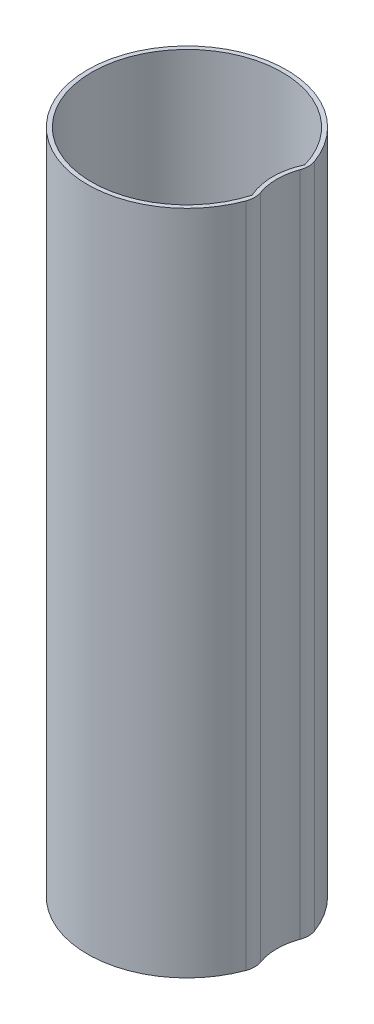
ISO-10303-21;
HEADER;
FILE_DESCRIPTION(('STEP AP214'),'2;1');
FILE_NAME('part.step','',(''),(''),'','','');
FILE_SCHEMA(('AUTOMOTIVE_DESIGN { 1 0 10303 214 1 1 1 1 }'));
ENDSEC;
DATA;
#1=APPLICATION_CONTEXT('core data for automotive mechanical design processes');
#2=APPLICATION_PROTOCOL_DEFINITION('international standard','automotive_design',2000,#1);
#3=PRODUCT_CONTEXT('',#1,'mechanical');
#4=PRODUCT('Part','Part','',(#3));
#5=PRODUCT_RELATED_PRODUCT_CATEGORY('part','',(#4));
#6=PRODUCT_DEFINITION_FORMATION('','',#4);
#7=PRODUCT_DEFINITION_CONTEXT('part definition',#1,'design');
#8=PRODUCT_DEFINITION('design','',#6,#7);
#9=PRODUCT_DEFINITION_SHAPE('','',#8);
#10=(LENGTH_UNIT() NAMED_UNIT(*) SI_UNIT(.MILLI.,.METRE.));
#11=(NAMED_UNIT(*) PLANE_ANGLE_UNIT() SI_UNIT($,.RADIAN.));
#12=(NAMED_UNIT(*) SI_UNIT($,.STERADIAN.) SOLID_ANGLE_UNIT());
#13=UNCERTAINTY_MEASURE_WITH_UNIT(LENGTH_MEASURE(1.E-05),#10,'distance_accuracy_value','');
#14=(GEOMETRIC_REPRESENTATION_CONTEXT(3) GLOBAL_UNCERTAINTY_ASSIGNED_CONTEXT((#13)) GLOBAL_UNIT_ASSIGNED_CONTEXT((#10,
#11,#12)) REPRESENTATION_CONTEXT('',''));
#15=CARTESIAN_POINT('',(0.,0.,0.));
#16=DIRECTION('',(0.,0.,1.));
#17=DIRECTION('',(1.,0.,0.));
#18=AXIS2_PLACEMENT_3D('',#15,#16,#17);
#19=CARTESIAN_POINT('',(7.,63.,0.));
#20=DIRECTION('',(0.,1.,0.));
#21=DIRECTION('',(0.,0.,1.));
#22=AXIS2_PLACEMENT_3D('',#19,#20,#21);
#23=PLANE('',#22);
#24=CARTESIAN_POINT('',(0.,63.,0.));
#25=DIRECTION('',(0.,1.,0.));
#26=DIRECTION('',(0.,0.,1.));
#27=AXIS2_PLACEMENT_3D('',#24,#25,#26);
#28=CIRCLE('',#27,9.4);
#29=CARTESIAN_POINT('',(8.82429536679536,63.,-3.23910655575791));
#30=VERTEX_POINT('',#29);
#31=CARTESIAN_POINT('',(8.82429536679537,63.,3.23910655575791));
#32=VERTEX_POINT('',#31);
#33=EDGE_CURVE('E113',#30,#32,#28,.T.);
#34=ORIENTED_EDGE('',*,*,#33,.T.);
#35=CARTESIAN_POINT('',(6.94678571428571,63.,2.54993494814984));
#36=DIRECTION('',(0.,1.,0.));
#37=DIRECTION('',(0.,0.,1.));
#38=AXIS2_PLACEMENT_3D('',#35,#36,#37);
#39=CIRCLE('',#38,2.);
#40=CARTESIAN_POINT('',(8.82764285714286,63.,1.86995229530988));
#41=VERTEX_POINT('',#40);
#42=EDGE_CURVE('E11',#32,#41,#39,.T.);
#43=ORIENTED_EDGE('',*,*,#42,.T.);
#44=CARTESIAN_POINT('',(14.,63.,0.));
#45=DIRECTION('',(0.,-1.,0.));
#46=DIRECTION('',(0.,0.,1.));
#47=AXIS2_PLACEMENT_3D('',#44,#45,#46);
#48=CIRCLE('',#47,5.5);
#49=CARTESIAN_POINT('',(8.82764285714286,63.,-1.86995229530989));
#50=VERTEX_POINT('',#49);
#51=EDGE_CURVE('E111',#41,#50,#48,.T.);
#52=ORIENTED_EDGE('',*,*,#51,.T.);
#53=CARTESIAN_POINT('',(6.94678571428571,63.,-2.54993494814984));
#54=DIRECTION('',(0.,1.,0.));
#55=DIRECTION('',(0.,0.,1.));
#56=AXIS2_PLACEMENT_3D('',#53,#54,#55);
#57=CIRCLE('',#56,2.);
#58=EDGE_CURVE('E42',#50,#30,#57,.T.);
#59=ORIENTED_EDGE('',*,*,#58,.T.);
#60=EDGE_LOOP('',(#34,#43,#52,#59));
#61=FACE_BOUND('',#60,.T.);
#62=CARTESIAN_POINT('',(14.,63.,0.));
#63=DIRECTION('',(0.,-1.,0.));
#64=DIRECTION('',(0.,0.,1.));
#65=AXIS2_PLACEMENT_3D('',#62,#63,#64);
#66=CIRCLE('',#65,5.9);
#67=CARTESIAN_POINT('',(8.64964285714286,63.,2.48670031243766));
#68=VERTEX_POINT('',#67);
#69=CARTESIAN_POINT('',(8.64964285714286,63.,-2.48670031243766));
#70=VERTEX_POINT('',#69);
#71=EDGE_CURVE('E87',#68,#70,#66,.T.);
#72=ORIENTED_EDGE('',*,*,#71,.F.);
#73=CARTESIAN_POINT('',(0.,63.,0.));
#74=DIRECTION('',(0.,1.,0.));
#75=DIRECTION('',(0.,0.,1.));
#76=AXIS2_PLACEMENT_3D('',#73,#74,#75);
#77=CIRCLE('',#76,9.);
#78=EDGE_CURVE('E97',#70,#68,#77,.T.);
#79=ORIENTED_EDGE('',*,*,#78,.F.);
#80=EDGE_LOOP('',(#72,#79));
#81=FACE_BOUND('',#80,.T.);
#82=ADVANCED_FACE('F34',(#61,#81),#23,.T.);
#83=CARTESIAN_POINT('',(7.,0.,0.));
#84=DIRECTION('',(0.,1.,0.));
#85=DIRECTION('',(0.,0.,1.));
#86=AXIS2_PLACEMENT_3D('',#83,#84,#85);
#87=PLANE('',#86);
#88=CARTESIAN_POINT('',(14.,0.,0.));
#89=DIRECTION('',(0.,-1.,0.));
#90=DIRECTION('',(0.,0.,1.));
#91=AXIS2_PLACEMENT_3D('',#88,#89,#90);
#92=CIRCLE('',#91,5.5);
#93=CARTESIAN_POINT('',(8.82764285714286,0.,1.86995229530988));
#94=VERTEX_POINT('',#93);
#95=CARTESIAN_POINT('',(8.82764285714286,0.,-1.86995229530989));
#96=VERTEX_POINT('',#95);
#97=EDGE_CURVE('E110',#94,#96,#92,.T.);
#98=ORIENTED_EDGE('',*,*,#97,.F.);
#99=CARTESIAN_POINT('',(6.94678571428571,0.,2.54993494814984));
#100=DIRECTION('',(0.,1.,0.));
#101=DIRECTION('',(0.,0.,1.));
#102=AXIS2_PLACEMENT_3D('',#99,#100,#101);
#103=CIRCLE('',#102,2.);
#104=CARTESIAN_POINT('',(8.82429536679537,0.,3.23910655575791));
#105=VERTEX_POINT('',#104);
#106=EDGE_CURVE('E126',#94,#105,#103,.F.);
#107=ORIENTED_EDGE('',*,*,#106,.T.);
#108=CARTESIAN_POINT('',(0.,0.,0.));
#109=DIRECTION('',(0.,1.,0.));
#110=DIRECTION('',(0.,0.,1.));
#111=AXIS2_PLACEMENT_3D('',#108,#109,#110);
#112=CIRCLE('',#111,9.4);
#113=CARTESIAN_POINT('',(8.82429536679536,0.,-3.23910655575791));
#114=VERTEX_POINT('',#113);
#115=EDGE_CURVE('E114',#114,#105,#112,.T.);
#116=ORIENTED_EDGE('',*,*,#115,.F.);
#117=CARTESIAN_POINT('',(6.94678571428571,0.,-2.54993494814984));
#118=DIRECTION('',(0.,1.,0.));
#119=DIRECTION('',(0.,0.,1.));
#120=AXIS2_PLACEMENT_3D('',#117,#118,#119);
#121=CIRCLE('',#120,2.);
#122=EDGE_CURVE('E124',#114,#96,#121,.F.);
#123=ORIENTED_EDGE('',*,*,#122,.T.);
#124=EDGE_LOOP('',(#98,#107,#116,#123));
#125=FACE_BOUND('',#124,.T.);
#126=CARTESIAN_POINT('',(0.,0.,0.));
#127=DIRECTION('',(0.,1.,0.));
#128=DIRECTION('',(0.,0.,1.));
#129=AXIS2_PLACEMENT_3D('',#126,#127,#128);
#130=CIRCLE('',#129,9.);
#131=CARTESIAN_POINT('',(8.64964285714286,0.,-2.48670031243766));
#132=VERTEX_POINT('',#131);
#133=CARTESIAN_POINT('',(8.64964285714286,0.,2.48670031243766));
#134=VERTEX_POINT('',#133);
#135=EDGE_CURVE('E102',#132,#134,#130,.T.);
#136=ORIENTED_EDGE('',*,*,#135,.T.);
#137=CARTESIAN_POINT('',(14.,0.,0.));
#138=DIRECTION('',(0.,-1.,0.));
#139=DIRECTION('',(0.,0.,1.));
#140=AXIS2_PLACEMENT_3D('',#137,#138,#139);
#141=CIRCLE('',#140,5.9);
#142=EDGE_CURVE('E104',#134,#132,#141,.T.);
#143=ORIENTED_EDGE('',*,*,#142,.T.);
#144=EDGE_LOOP('',(#136,#143));
#145=FACE_BOUND('',#144,.T.);
#146=ADVANCED_FACE('F137',(#125,#145),#87,.F.);
#147=CARTESIAN_POINT('',(14.,63.,0.));
#148=DIRECTION('',(0.,-1.,0.));
#149=DIRECTION('',(0.,0.,-1.));
#150=AXIS2_PLACEMENT_3D('',#147,#148,#149);
#151=CYLINDRICAL_SURFACE('',#150,5.5);
#152=ORIENTED_EDGE('',*,*,#51,.F.);
#153=DIRECTION('',(0.,-1.,0.));
#154=VECTOR('',#153,1.);
#155=CARTESIAN_POINT('',(8.82764285714286,63.,1.86995229530988));
#156=LINE('',#155,#154);
#157=EDGE_CURVE('E121',#41,#94,#156,.T.);
#158=ORIENTED_EDGE('',*,*,#157,.T.);
#159=ORIENTED_EDGE('',*,*,#97,.T.);
#160=DIRECTION('',(0.,-1.,0.));
#161=VECTOR('',#160,1.);
#162=CARTESIAN_POINT('',(8.82764285714286,63.,-1.86995229530989));
#163=LINE('',#162,#161);
#164=EDGE_CURVE('E116',#96,#50,#163,.F.);
#165=ORIENTED_EDGE('',*,*,#164,.T.);
#166=EDGE_LOOP('',(#152,#158,#159,#165));
#167=FACE_BOUND('',#166,.T.);
#168=ADVANCED_FACE('F145',(#167),#151,.F.);
#169=CARTESIAN_POINT('',(0.,63.,0.));
#170=DIRECTION('',(0.,-1.,0.));
#171=DIRECTION('',(0.,0.,-1.));
#172=AXIS2_PLACEMENT_3D('',#169,#170,#171);
#173=CYLINDRICAL_SURFACE('',#172,9.4);
#174=ORIENTED_EDGE('',*,*,#115,.T.);
#175=DIRECTION('',(0.,-1.,0.));
#176=VECTOR('',#175,1.);
#177=CARTESIAN_POINT('',(8.82429536679537,63.,3.23910655575791));
#178=LINE('',#177,#176);
#179=EDGE_CURVE('E49',#105,#32,#178,.F.);
#180=ORIENTED_EDGE('',*,*,#179,.T.);
#181=ORIENTED_EDGE('',*,*,#33,.F.);
#182=DIRECTION('',(0.,-1.,0.));
#183=VECTOR('',#182,1.);
#184=CARTESIAN_POINT('',(8.82429536679536,63.,-3.23910655575791));
#185=LINE('',#184,#183);
#186=EDGE_CURVE('E128',#30,#114,#185,.T.);
#187=ORIENTED_EDGE('',*,*,#186,.T.);
#188=EDGE_LOOP('',(#174,#180,#181,#187));
#189=FACE_BOUND('',#188,.T.);
#190=ADVANCED_FACE('F133',(#189),#173,.T.);
#191=CARTESIAN_POINT('',(0.,63.,0.));
#192=DIRECTION('',(0.,-1.,0.));
#193=DIRECTION('',(0.,0.,-1.));
#194=AXIS2_PLACEMENT_3D('',#191,#192,#193);
#195=CYLINDRICAL_SURFACE('',#194,9.);
#196=ORIENTED_EDGE('',*,*,#135,.F.);
#197=DIRECTION('',(0.,-1.,0.));
#198=VECTOR('',#197,1.);
#199=CARTESIAN_POINT('',(8.64964285714286,63.,-2.48670031243766));
#200=LINE('',#199,#198);
#201=EDGE_CURVE('E90',#70,#132,#200,.T.);
#202=ORIENTED_EDGE('',*,*,#201,.F.);
#203=ORIENTED_EDGE('',*,*,#78,.T.);
#204=DIRECTION('',(0.,-1.,0.));
#205=VECTOR('',#204,1.);
#206=CARTESIAN_POINT('',(8.64964285714286,63.,2.48670031243766));
#207=LINE('',#206,#205);
#208=EDGE_CURVE('E93',#68,#134,#207,.T.);
#209=ORIENTED_EDGE('',*,*,#208,.T.);
#210=EDGE_LOOP('',(#196,#202,#203,#209));
#211=FACE_BOUND('',#210,.T.);
#212=ADVANCED_FACE('F100',(#211),#195,.F.);
#213=CARTESIAN_POINT('',(14.,63.,0.));
#214=DIRECTION('',(0.,-1.,0.));
#215=DIRECTION('',(0.,0.,-1.));
#216=AXIS2_PLACEMENT_3D('',#213,#214,#215);
#217=CYLINDRICAL_SURFACE('',#216,5.9);
#218=ORIENTED_EDGE('',*,*,#142,.F.);
#219=ORIENTED_EDGE('',*,*,#208,.F.);
#220=ORIENTED_EDGE('',*,*,#71,.T.);
#221=ORIENTED_EDGE('',*,*,#201,.T.);
#222=EDGE_LOOP('',(#218,#219,#220,#221));
#223=FACE_BOUND('',#222,.T.);
#224=ADVANCED_FACE('F89',(#223),#217,.T.);
#225=CARTESIAN_POINT('',(6.94678571428571,63.,2.54993494814984));
#226=DIRECTION('',(0.,1.,0.));
#227=DIRECTION('',(0.,0.,1.));
#228=AXIS2_PLACEMENT_3D('',#225,#226,#227);
#229=CYLINDRICAL_SURFACE('',#228,2.);
#230=ORIENTED_EDGE('',*,*,#42,.F.);
#231=ORIENTED_EDGE('',*,*,#179,.F.);
#232=ORIENTED_EDGE('',*,*,#106,.F.);
#233=ORIENTED_EDGE('',*,*,#157,.F.);
#234=EDGE_LOOP('',(#230,#231,#232,#233));
#235=FACE_BOUND('',#234,.T.);
#236=ADVANCED_FACE('F142',(#235),#229,.T.);
#237=CARTESIAN_POINT('',(6.94678571428571,63.,-2.54993494814984));
#238=DIRECTION('',(0.,1.,0.));
#239=DIRECTION('',(0.,0.,1.));
#240=AXIS2_PLACEMENT_3D('',#237,#238,#239);
#241=CYLINDRICAL_SURFACE('',#240,2.);
#242=ORIENTED_EDGE('',*,*,#58,.F.);
#243=ORIENTED_EDGE('',*,*,#164,.F.);
#244=ORIENTED_EDGE('',*,*,#122,.F.);
#245=ORIENTED_EDGE('',*,*,#186,.F.);
#246=EDGE_LOOP('',(#242,#243,#244,#245));
#247=FACE_BOUND('',#246,.T.);
#248=ADVANCED_FACE('F36',(#247),#241,.T.);
#249=CLOSED_SHELL('',(#82,#146,#168,#190,#212,#224,#236,#248));
#250=MANIFOLD_SOLID_BREP('B2',#249);
#251=ADVANCED_BREP_SHAPE_REPRESENTATION('',(#18,#250),#14);
#252=SHAPE_DEFINITION_REPRESENTATION(#9,#251);
ENDSEC;
END-ISO-10303-21;
